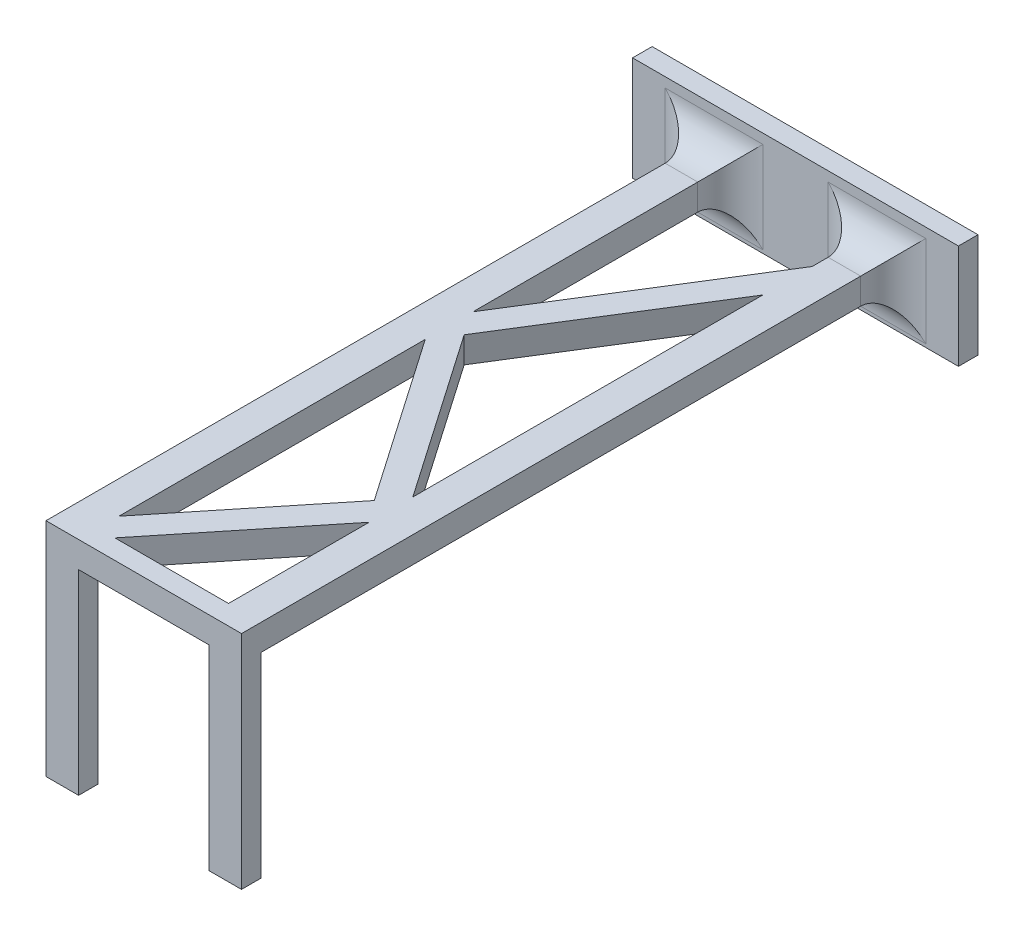
ISO-10303-21;
HEADER;
FILE_DESCRIPTION(('STEP AP214'),'2;1');
FILE_NAME('part.step','',(''),(''),'','','');
FILE_SCHEMA(('AUTOMOTIVE_DESIGN { 1 0 10303 214 1 1 1 1 }'));
ENDSEC;
DATA;
#1=APPLICATION_CONTEXT('core data for automotive mechanical design processes');
#2=APPLICATION_PROTOCOL_DEFINITION('international standard','automotive_design',2000,#1);
#3=PRODUCT_CONTEXT('',#1,'mechanical');
#4=PRODUCT('Part','Part','',(#3));
#5=PRODUCT_RELATED_PRODUCT_CATEGORY('part','',(#4));
#6=PRODUCT_DEFINITION_FORMATION('','',#4);
#7=PRODUCT_DEFINITION_CONTEXT('part definition',#1,'design');
#8=PRODUCT_DEFINITION('design','',#6,#7);
#9=PRODUCT_DEFINITION_SHAPE('','',#8);
#10=(LENGTH_UNIT() NAMED_UNIT(*) SI_UNIT(.MILLI.,.METRE.));
#11=(NAMED_UNIT(*) PLANE_ANGLE_UNIT() SI_UNIT($,.RADIAN.));
#12=(NAMED_UNIT(*) SI_UNIT($,.STERADIAN.) SOLID_ANGLE_UNIT());
#13=UNCERTAINTY_MEASURE_WITH_UNIT(LENGTH_MEASURE(1.E-05),#10,'distance_accuracy_value','');
#14=(GEOMETRIC_REPRESENTATION_CONTEXT(3) GLOBAL_UNCERTAINTY_ASSIGNED_CONTEXT((#13)) GLOBAL_UNIT_ASSIGNED_CONTEXT((#10,
#11,#12)) REPRESENTATION_CONTEXT('',''));
#15=CARTESIAN_POINT('',(0.,0.,0.));
#16=DIRECTION('',(0.,0.,1.));
#17=DIRECTION('',(1.,0.,0.));
#18=AXIS2_PLACEMENT_3D('',#15,#16,#17);
#19=CARTESIAN_POINT('',(-22.1490467937608,-2.12911611785095,103.));
#20=DIRECTION('',(0.,1.,0.));
#21=DIRECTION('',(0.,0.,1.));
#22=AXIS2_PLACEMENT_3D('',#19,#20,#21);
#23=PLANE('',#22);
#24=DIRECTION('',(0.,0.,-1.));
#25=VECTOR('',#24,1.);
#26=CARTESIAN_POINT('',(17.8509532062392,-2.12911611785095,0.));
#27=LINE('',#26,#25);
#28=CARTESIAN_POINT('',(17.8509532062392,-2.12911611785095,71.7156301458142));
#29=VERTEX_POINT('',#28);
#30=CARTESIAN_POINT('',(17.8509532062392,-2.12911611785095,18.0112892517933));
#31=VERTEX_POINT('',#30);
#32=EDGE_CURVE('E549',#29,#31,#27,.T.);
#33=ORIENTED_EDGE('',*,*,#32,.T.);
#34=DIRECTION('',(0.529773344430949,0.,-0.848139259514879));
#35=VECTOR('',#34,1.);
#36=CARTESIAN_POINT('',(20.9337691139666,-2.12911611785095,13.0758631328949));
#37=LINE('',#36,#35);
#38=CARTESIAN_POINT('',(0.231428363725535,-2.12911611785095,46.2192217761925));
#39=VERTEX_POINT('',#38);
#40=EDGE_CURVE('E536',#39,#31,#37,.T.);
#41=ORIENTED_EDGE('',*,*,#40,.F.);
#42=DIRECTION('',(-0.568515396426221,0.,-0.822672622630859));
#43=VECTOR('',#42,1.);
#44=CARTESIAN_POINT('',(-21.4601964163114,-2.12911611785095,14.8302638709278));
#45=LINE('',#44,#43);
#46=EDGE_CURVE('E545',#29,#39,#45,.T.);
#47=ORIENTED_EDGE('',*,*,#46,.F.);
#48=EDGE_LOOP('',(#33,#41,#47));
#49=FACE_BOUND('',#48,.T.);
#50=DIRECTION('',(-0.568515396426221,0.,-0.82267262263086));
#51=VECTOR('',#50,1.);
#52=CARTESIAN_POINT('',(-24.7508869068349,-2.12911611785095,17.1043254566327));
#53=LINE('',#52,#51);
#54=CARTESIAN_POINT('',(15.3554770407737,-2.12911611785095,75.1404100031111));
#55=VERTEX_POINT('',#54);
#56=CARTESIAN_POINT('',(-2.14904679376084,-2.12911611785095,49.810414331253));
#57=VERTEX_POINT('',#56);
#58=EDGE_CURVE('E524',#55,#57,#53,.T.);
#59=ORIENTED_EDGE('',*,*,#58,.T.);
#60=DIRECTION('',(0.,0.,-1.));
#61=VECTOR('',#60,1.);
#62=CARTESIAN_POINT('',(-2.14904679376083,-2.12911611785095,0.));
#63=LINE('',#62,#61);
#64=CARTESIAN_POINT('',(-2.14904679376085,-2.12911611785095,96.8166427882165));
#65=VERTEX_POINT('',#64);
#66=EDGE_CURVE('E510',#65,#57,#63,.T.);
#67=ORIENTED_EDGE('',*,*,#66,.F.);
#68=DIRECTION('',(0.628267538621431,0.,-0.777997364979194));
#69=VECTOR('',#68,1.);
#70=CARTESIAN_POINT('',(46.022279396746,-2.12911611785095,37.1650412969132));
#71=LINE('',#70,#69);
#72=EDGE_CURVE('E520',#65,#55,#71,.T.);
#73=ORIENTED_EDGE('',*,*,#72,.T.);
#74=EDGE_LOOP('',(#59,#67,#73));
#75=FACE_BOUND('',#74,.T.);
#76=DIRECTION('',(0.,0.,-1.));
#77=VECTOR('',#76,1.);
#78=CARTESIAN_POINT('',(17.8509532062392,-2.12911611785095,0.));
#79=LINE('',#78,#77);
#80=CARTESIAN_POINT('',(17.8509532062392,-2.12911611785095,10.4608904972154));
#81=VERTEX_POINT('',#80);
#82=CARTESIAN_POINT('',(17.8509532062392,-2.12911611785095,8.00000000000001));
#83=VERTEX_POINT('',#82);
#84=EDGE_CURVE('E557',#81,#83,#79,.T.);
#85=ORIENTED_EDGE('',*,*,#84,.T.);
#86=DIRECTION('',(1.,0.,0.));
#87=VECTOR('',#86,1.);
#88=CARTESIAN_POINT('',(-22.1490467937608,-2.12911611785095,8.00000000000001));
#89=LINE('',#88,#87);
#90=CARTESIAN_POINT('',(22.8509532062393,-2.12911611785095,8.00000000000001));
#91=VERTEX_POINT('',#90);
#92=EDGE_CURVE('E415',#83,#91,#89,.T.);
#93=ORIENTED_EDGE('',*,*,#92,.T.);
#94=DIRECTION('',(0.,0.,-1.));
#95=VECTOR('',#94,1.);
#96=CARTESIAN_POINT('',(22.8509532062393,-2.12911611785095,0.));
#97=LINE('',#96,#95);
#98=CARTESIAN_POINT('',(22.8509532062392,-2.12911611785095,100.));
#99=VERTEX_POINT('',#98);
#100=EDGE_CURVE('E505',#99,#91,#97,.T.);
#101=ORIENTED_EDGE('',*,*,#100,.F.);
#102=DIRECTION('',(1.,0.,0.));
#103=VECTOR('',#102,1.);
#104=CARTESIAN_POINT('',(17.8509532062392,-2.12911611785095,100.));
#105=LINE('',#104,#103);
#106=CARTESIAN_POINT('',(17.8509532062392,-2.12911611785095,100.));
#107=VERTEX_POINT('',#106);
#108=EDGE_CURVE('E596',#107,#99,#105,.T.);
#109=ORIENTED_EDGE('',*,*,#108,.F.);
#110=DIRECTION('',(0.,0.,-1.));
#111=VECTOR('',#110,1.);
#112=CARTESIAN_POINT('',(17.8509532062392,-2.12911611785095,100.));
#113=LINE('',#112,#111);
#114=CARTESIAN_POINT('',(17.8509532062392,-2.12911611785095,78.4169219862328));
#115=VERTEX_POINT('',#114);
#116=EDGE_CURVE('E489',#107,#115,#113,.T.);
#117=ORIENTED_EDGE('',*,*,#116,.T.);
#118=DIRECTION('',(0.628267538621431,0.,-0.777997364979194));
#119=VECTOR('',#118,1.);
#120=CARTESIAN_POINT('',(0.421656000397723,-2.12911611785095,100.));
#121=LINE('',#120,#119);
#122=CARTESIAN_POINT('',(0.421656000397719,-2.12911611785095,100.));
#123=VERTEX_POINT('',#122);
#124=EDGE_CURVE('E498',#123,#115,#121,.T.);
#125=ORIENTED_EDGE('',*,*,#124,.F.);
#126=DIRECTION('',(-1.,0.,0.));
#127=VECTOR('',#126,1.);
#128=CARTESIAN_POINT('',(17.8509532062392,-2.12911611785095,100.));
#129=LINE('',#128,#127);
#130=EDGE_CURVE('E502',#107,#123,#129,.T.);
#131=ORIENTED_EDGE('',*,*,#130,.F.);
#132=DIRECTION('',(0.,0.,-1.));
#133=VECTOR('',#132,1.);
#134=CARTESIAN_POINT('',(17.8509532062392,-2.12911611785095,103.));
#135=LINE('',#134,#133);
#136=CARTESIAN_POINT('',(17.8509532062392,-2.12911611785095,103.));
#137=VERTEX_POINT('',#136);
#138=EDGE_CURVE('E628',#137,#107,#135,.T.);
#139=ORIENTED_EDGE('',*,*,#138,.F.);
#140=DIRECTION('',(1.,0.,0.));
#141=VECTOR('',#140,1.);
#142=CARTESIAN_POINT('',(-22.1490467937608,-2.12911611785095,103.));
#143=LINE('',#142,#141);
#144=CARTESIAN_POINT('',(-2.14904679376084,-2.12911611785095,103.));
#145=VERTEX_POINT('',#144);
#146=EDGE_CURVE('E613',#145,#137,#143,.T.);
#147=ORIENTED_EDGE('',*,*,#146,.F.);
#148=DIRECTION('',(0.,0.,1.));
#149=VECTOR('',#148,1.);
#150=CARTESIAN_POINT('',(-2.14904679376083,-2.12911611785095,103.));
#151=LINE('',#150,#149);
#152=CARTESIAN_POINT('',(-2.14904679376083,-2.12911611785095,100.));
#153=VERTEX_POINT('',#152);
#154=EDGE_CURVE('E583',#153,#145,#151,.T.);
#155=ORIENTED_EDGE('',*,*,#154,.F.);
#156=DIRECTION('',(1.,0.,0.));
#157=VECTOR('',#156,1.);
#158=CARTESIAN_POINT('',(-7.14904679376083,-2.12911611785095,100.));
#159=LINE('',#158,#157);
#160=CARTESIAN_POINT('',(-7.14904679376083,-2.12911611785095,100.));
#161=VERTEX_POINT('',#160);
#162=EDGE_CURVE('E593',#161,#153,#159,.T.);
#163=ORIENTED_EDGE('',*,*,#162,.F.);
#164=DIRECTION('',(0.,0.,-1.));
#165=VECTOR('',#164,1.);
#166=CARTESIAN_POINT('',(-7.14904679376082,-2.12911611785095,0.));
#167=LINE('',#166,#165);
#168=CARTESIAN_POINT('',(-7.14904679376082,-2.12911611785095,8.00000000000001));
#169=VERTEX_POINT('',#168);
#170=EDGE_CURVE('E479',#161,#169,#167,.T.);
#171=ORIENTED_EDGE('',*,*,#170,.T.);
#172=DIRECTION('',(1.,0.,0.));
#173=VECTOR('',#172,1.);
#174=CARTESIAN_POINT('',(-22.1490467937608,-2.12911611785095,8.00000000000001));
#175=LINE('',#174,#173);
#176=CARTESIAN_POINT('',(-2.14904679376083,-2.12911611785095,8.00000000000001));
#177=VERTEX_POINT('',#176);
#178=EDGE_CURVE('E412',#169,#177,#175,.T.);
#179=ORIENTED_EDGE('',*,*,#178,.T.);
#180=DIRECTION('',(0.,0.,-1.));
#181=VECTOR('',#180,1.);
#182=CARTESIAN_POINT('',(-2.14904679376084,-2.12911611785095,0.));
#183=LINE('',#182,#181);
#184=CARTESIAN_POINT('',(-2.14904679376082,-2.12911611785095,42.4798385409641));
#185=VERTEX_POINT('',#184);
#186=EDGE_CURVE('E563',#185,#177,#183,.T.);
#187=ORIENTED_EDGE('',*,*,#186,.F.);
#188=DIRECTION('',(0.52977334443095,0.,-0.848139259514878));
#189=VECTOR('',#188,1.);
#190=CARTESIAN_POINT('',(17.5412120759071,-2.12911611785095,10.9567697551711));
#191=LINE('',#190,#189);
#192=EDGE_CURVE('E484',#185,#81,#191,.T.);
#193=ORIENTED_EDGE('',*,*,#192,.T.);
#194=EDGE_LOOP('',(#85,#93,#101,#109,#117,#125,#131,#139,#147,#155,#163,#171,#179,#187,#193));
#195=FACE_BOUND('',#194,.T.);
#196=ADVANCED_FACE('F102',(#49,#75,#195),#23,.F.);
#197=CARTESIAN_POINT('',(-22.1490467937608,1.87088388214905,103.));
#198=DIRECTION('',(0.,-1.,0.));
#199=DIRECTION('',(0.,0.,-1.));
#200=AXIS2_PLACEMENT_3D('',#197,#198,#199);
#201=PLANE('',#200);
#202=DIRECTION('',(0.,0.,-1.));
#203=VECTOR('',#202,1.);
#204=CARTESIAN_POINT('',(17.8509532062392,1.87088388214905,103.));
#205=LINE('',#204,#203);
#206=CARTESIAN_POINT('',(17.8509532062392,1.87088388214905,71.7156301458142));
#207=VERTEX_POINT('',#206);
#208=CARTESIAN_POINT('',(17.8509532062392,1.87088388214905,18.0112892517933));
#209=VERTEX_POINT('',#208);
#210=EDGE_CURVE('E367',#207,#209,#205,.T.);
#211=ORIENTED_EDGE('',*,*,#210,.F.);
#212=DIRECTION('',(-0.568515396426221,0.,-0.82267262263086));
#213=VECTOR('',#212,1.);
#214=CARTESIAN_POINT('',(19.5543269493781,1.87088388214905,74.1805043662795));
#215=LINE('',#214,#213);
#216=CARTESIAN_POINT('',(0.231428363725535,1.87088388214905,46.2192217761925));
#217=VERTEX_POINT('',#216);
#218=EDGE_CURVE('E359',#207,#217,#215,.T.);
#219=ORIENTED_EDGE('',*,*,#218,.T.);
#220=DIRECTION('',(0.529773344430949,0.,-0.848139259514879));
#221=VECTOR('',#220,1.);
#222=CARTESIAN_POINT('',(-31.5626997729727,1.87088388214905,97.1199486214541));
#223=LINE('',#222,#221);
#224=EDGE_CURVE('E363',#217,#209,#223,.T.);
#225=ORIENTED_EDGE('',*,*,#224,.T.);
#226=EDGE_LOOP('',(#211,#219,#225));
#227=FACE_BOUND('',#226,.T.);
#228=DIRECTION('',(-0.568515396426221,0.,-0.82267262263086));
#229=VECTOR('',#228,1.);
#230=CARTESIAN_POINT('',(16.2636364588546,1.87088388214905,76.4545659519844));
#231=LINE('',#230,#229);
#232=CARTESIAN_POINT('',(15.3554770407737,1.87088388214905,75.1404100031111));
#233=VERTEX_POINT('',#232);
#234=CARTESIAN_POINT('',(-2.14904679376084,1.87088388214905,49.810414331253));
#235=VERTEX_POINT('',#234);
#236=EDGE_CURVE('E345',#233,#235,#231,.T.);
#237=ORIENTED_EDGE('',*,*,#236,.F.);
#238=DIRECTION('',(0.628267538621431,0.,-0.777997364979194));
#239=VECTOR('',#238,1.);
#240=CARTESIAN_POINT('',(-13.0658149940762,1.87088388214905,110.33511441349));
#241=LINE('',#240,#239);
#242=CARTESIAN_POINT('',(-2.14904679376086,1.87088388214905,96.8166427882165));
#243=VERTEX_POINT('',#242);
#244=EDGE_CURVE('E328',#243,#233,#241,.T.);
#245=ORIENTED_EDGE('',*,*,#244,.F.);
#246=DIRECTION('',(0.,0.,-1.));
#247=VECTOR('',#246,1.);
#248=CARTESIAN_POINT('',(-2.14904679376085,1.87088388214905,103.));
#249=LINE('',#248,#247);
#250=EDGE_CURVE('E341',#243,#235,#249,.T.);
#251=ORIENTED_EDGE('',*,*,#250,.T.);
#252=EDGE_LOOP('',(#237,#245,#251));
#253=FACE_BOUND('',#252,.T.);
#254=DIRECTION('',(0.,0.,-1.));
#255=VECTOR('',#254,1.);
#256=CARTESIAN_POINT('',(17.8509532062392,1.87088388214905,103.));
#257=LINE('',#256,#255);
#258=CARTESIAN_POINT('',(17.8509532062392,1.87088388214905,100.));
#259=VERTEX_POINT('',#258);
#260=CARTESIAN_POINT('',(17.8509532062392,1.87088388214905,78.4169219862328));
#261=VERTEX_POINT('',#260);
#262=EDGE_CURVE('E374',#259,#261,#257,.T.);
#263=ORIENTED_EDGE('',*,*,#262,.F.);
#264=DIRECTION('',(-1.,0.,0.));
#265=VECTOR('',#264,1.);
#266=CARTESIAN_POINT('',(-22.1490467937608,1.87088388214905,100.));
#267=LINE('',#266,#265);
#268=CARTESIAN_POINT('',(0.421656000397723,1.87088388214905,100.));
#269=VERTEX_POINT('',#268);
#270=EDGE_CURVE('E378',#259,#269,#267,.T.);
#271=ORIENTED_EDGE('',*,*,#270,.T.);
#272=DIRECTION('',(0.628267538621431,0.,-0.777997364979194));
#273=VECTOR('',#272,1.);
#274=CARTESIAN_POINT('',(-9.95382553415938,1.87088388214905,112.848184567975));
#275=LINE('',#274,#273);
#276=EDGE_CURVE('E370',#269,#261,#275,.T.);
#277=ORIENTED_EDGE('',*,*,#276,.T.);
#278=EDGE_LOOP('',(#263,#271,#277));
#279=FACE_BOUND('',#278,.T.);
#280=DIRECTION('',(0.,0.,-1.));
#281=VECTOR('',#280,1.);
#282=CARTESIAN_POINT('',(-2.14904679376078,1.87088388214905,103.));
#283=LINE('',#282,#281);
#284=CARTESIAN_POINT('',(-2.14904679376082,1.87088388214905,42.4798385409641));
#285=VERTEX_POINT('',#284);
#286=CARTESIAN_POINT('',(-2.14904679376083,1.87088388214905,8.00000000000001));
#287=VERTEX_POINT('',#286);
#288=EDGE_CURVE('E348',#285,#287,#283,.T.);
#289=ORIENTED_EDGE('',*,*,#288,.T.);
#290=DIRECTION('',(-1.,0.,0.));
#291=VECTOR('',#290,1.);
#292=CARTESIAN_POINT('',(-22.1490467937608,1.87088388214905,8.00000000000001));
#293=LINE('',#292,#291);
#294=CARTESIAN_POINT('',(-7.14904679376082,1.87088388214905,8.00000000000001));
#295=VERTEX_POINT('',#294);
#296=EDGE_CURVE('E428',#287,#295,#293,.T.);
#297=ORIENTED_EDGE('',*,*,#296,.T.);
#298=DIRECTION('',(0.,0.,-1.));
#299=VECTOR('',#298,1.);
#300=CARTESIAN_POINT('',(-7.14904679376083,1.87088388214905,103.));
#301=LINE('',#300,#299);
#302=CARTESIAN_POINT('',(-7.14904679376083,1.87088388214905,103.));
#303=VERTEX_POINT('',#302);
#304=EDGE_CURVE('E573',#303,#295,#301,.T.);
#305=ORIENTED_EDGE('',*,*,#304,.F.);
#306=DIRECTION('',(-1.,0.,0.));
#307=VECTOR('',#306,1.);
#308=CARTESIAN_POINT('',(-22.1490467937608,1.87088388214905,103.));
#309=LINE('',#308,#307);
#310=CARTESIAN_POINT('',(22.8509532062392,1.87088388214905,103.));
#311=VERTEX_POINT('',#310);
#312=EDGE_CURVE('E334',#311,#303,#309,.T.);
#313=ORIENTED_EDGE('',*,*,#312,.F.);
#314=DIRECTION('',(0.,0.,-1.));
#315=VECTOR('',#314,1.);
#316=CARTESIAN_POINT('',(22.8509532062392,1.87088388214905,103.));
#317=LINE('',#316,#315);
#318=CARTESIAN_POINT('',(22.8509532062393,1.87088388214905,8.00000000000001));
#319=VERTEX_POINT('',#318);
#320=EDGE_CURVE('E483',#311,#319,#317,.T.);
#321=ORIENTED_EDGE('',*,*,#320,.T.);
#322=DIRECTION('',(-1.,0.,0.));
#323=VECTOR('',#322,1.);
#324=CARTESIAN_POINT('',(-22.1490467937608,1.87088388214905,8.00000000000001));
#325=LINE('',#324,#323);
#326=CARTESIAN_POINT('',(17.8509532062392,1.87088388214905,8.00000000000001));
#327=VERTEX_POINT('',#326);
#328=EDGE_CURVE('E425',#319,#327,#325,.T.);
#329=ORIENTED_EDGE('',*,*,#328,.T.);
#330=DIRECTION('',(0.,0.,-1.));
#331=VECTOR('',#330,1.);
#332=CARTESIAN_POINT('',(17.8509532062391,1.87088388214905,103.));
#333=LINE('',#332,#331);
#334=CARTESIAN_POINT('',(17.8509532062392,1.87088388214905,10.4608904972154));
#335=VERTEX_POINT('',#334);
#336=EDGE_CURVE('E355',#335,#327,#333,.T.);
#337=ORIENTED_EDGE('',*,*,#336,.F.);
#338=DIRECTION('',(0.52977334443095,0.,-0.848139259514878));
#339=VECTOR('',#338,1.);
#340=CARTESIAN_POINT('',(-34.9552568110323,1.87088388214905,95.0008552437302));
#341=LINE('',#340,#339);
#342=EDGE_CURVE('E352',#285,#335,#341,.T.);
#343=ORIENTED_EDGE('',*,*,#342,.F.);
#344=EDGE_LOOP('',(#289,#297,#305,#313,#321,#329,#337,#343));
#345=FACE_BOUND('',#344,.T.);
#346=ADVANCED_FACE('F663',(#227,#253,#279,#345),#201,.F.);
#347=CARTESIAN_POINT('',(0.,0.,103.));
#348=DIRECTION('',(0.,0.,1.));
#349=DIRECTION('',(1.,0.,0.));
#350=AXIS2_PLACEMENT_3D('',#347,#348,#349);
#351=PLANE('',#350);
#352=ORIENTED_EDGE('',*,*,#312,.T.);
#353=DIRECTION('',(0.,1.,0.));
#354=VECTOR('',#353,1.);
#355=CARTESIAN_POINT('',(-7.14904679376083,-32.1291161178509,103.));
#356=LINE('',#355,#354);
#357=CARTESIAN_POINT('',(-7.14904679376083,-32.1291161178509,103.));
#358=VERTEX_POINT('',#357);
#359=EDGE_CURVE('E592',#358,#303,#356,.T.);
#360=ORIENTED_EDGE('',*,*,#359,.F.);
#361=DIRECTION('',(-1.,0.,0.));
#362=VECTOR('',#361,1.);
#363=CARTESIAN_POINT('',(-7.14904679376083,-32.1291161178509,103.));
#364=LINE('',#363,#362);
#365=CARTESIAN_POINT('',(-2.14904679376083,-32.1291161178509,103.));
#366=VERTEX_POINT('',#365);
#367=EDGE_CURVE('E589',#366,#358,#364,.T.);
#368=ORIENTED_EDGE('',*,*,#367,.F.);
#369=DIRECTION('',(0.,1.,0.));
#370=VECTOR('',#369,1.);
#371=CARTESIAN_POINT('',(-2.14904679376083,-32.1291161178509,103.));
#372=LINE('',#371,#370);
#373=EDGE_CURVE('E602',#366,#145,#372,.T.);
#374=ORIENTED_EDGE('',*,*,#373,.T.);
#375=ORIENTED_EDGE('',*,*,#146,.T.);
#376=DIRECTION('',(0.,1.,0.));
#377=VECTOR('',#376,1.);
#378=CARTESIAN_POINT('',(17.8509532062392,-32.1291161178509,103.));
#379=LINE('',#378,#377);
#380=CARTESIAN_POINT('',(17.8509532062392,-32.1291161178509,103.));
#381=VERTEX_POINT('',#380);
#382=EDGE_CURVE('E620',#381,#137,#379,.T.);
#383=ORIENTED_EDGE('',*,*,#382,.F.);
#384=DIRECTION('',(-1.,0.,0.));
#385=VECTOR('',#384,1.);
#386=CARTESIAN_POINT('',(17.8509532062392,-32.1291161178509,103.));
#387=LINE('',#386,#385);
#388=CARTESIAN_POINT('',(22.8509532062392,-32.1291161178509,103.));
#389=VERTEX_POINT('',#388);
#390=EDGE_CURVE('E638',#389,#381,#387,.T.);
#391=ORIENTED_EDGE('',*,*,#390,.F.);
#392=DIRECTION('',(0.,1.,0.));
#393=VECTOR('',#392,1.);
#394=CARTESIAN_POINT('',(22.8509532062392,-32.1291161178509,103.));
#395=LINE('',#394,#393);
#396=EDGE_CURVE('E617',#389,#311,#395,.T.);
#397=ORIENTED_EDGE('',*,*,#396,.T.);
#398=EDGE_LOOP('',(#352,#360,#368,#374,#375,#383,#391,#397));
#399=FACE_BOUND('',#398,.T.);
#400=ADVANCED_FACE('F655',(#399),#351,.T.);
#401=CARTESIAN_POINT('',(-22.1490467937608,-7.62911611785095,3.));
#402=DIRECTION('',(0.,1.,0.));
#403=DIRECTION('',(0.,0.,1.));
#404=AXIS2_PLACEMENT_3D('',#401,#402,#403);
#405=PLANE('',#404);
#406=DIRECTION('',(1.,0.,0.));
#407=VECTOR('',#406,1.);
#408=CARTESIAN_POINT('',(-22.1490467937608,-7.62911611785095,3.));
#409=LINE('',#408,#407);
#410=CARTESIAN_POINT('',(-17.1490467937608,-7.62911611785095,3.));
#411=VERTEX_POINT('',#410);
#412=CARTESIAN_POINT('',(32.8509532062392,-7.62911611785095,3.));
#413=VERTEX_POINT('',#412);
#414=EDGE_CURVE('E316',#411,#413,#409,.T.);
#415=ORIENTED_EDGE('',*,*,#414,.F.);
#416=DIRECTION('',(0.,0.,1.));
#417=VECTOR('',#416,1.);
#418=CARTESIAN_POINT('',(-17.1490467937608,-7.62911611785095,-9.));
#419=LINE('',#418,#417);
#420=CARTESIAN_POINT('',(-17.1490467937608,-7.62911611785095,0.));
#421=VERTEX_POINT('',#420);
#422=EDGE_CURVE('E300',#421,#411,#419,.T.);
#423=ORIENTED_EDGE('',*,*,#422,.F.);
#424=DIRECTION('',(1.,0.,0.));
#425=VECTOR('',#424,1.);
#426=CARTESIAN_POINT('',(-22.1490467937608,-7.62911611785095,0.));
#427=LINE('',#426,#425);
#428=CARTESIAN_POINT('',(32.8509532062392,-7.62911611785095,0.));
#429=VERTEX_POINT('',#428);
#430=EDGE_CURVE('E331',#421,#429,#427,.T.);
#431=ORIENTED_EDGE('',*,*,#430,.T.);
#432=DIRECTION('',(0.,0.,1.));
#433=VECTOR('',#432,1.);
#434=CARTESIAN_POINT('',(32.8509532062392,-7.62911611785095,-9.));
#435=LINE('',#434,#433);
#436=EDGE_CURVE('E118',#429,#413,#435,.T.);
#437=ORIENTED_EDGE('',*,*,#436,.T.);
#438=EDGE_LOOP('',(#415,#423,#431,#437));
#439=FACE_BOUND('',#438,.T.);
#440=ADVANCED_FACE('F322',(#439),#405,.F.);
#441=CARTESIAN_POINT('',(-22.1490467937608,8.37088388214905,3.));
#442=DIRECTION('',(0.,-1.,0.));
#443=DIRECTION('',(0.,0.,-1.));
#444=AXIS2_PLACEMENT_3D('',#441,#442,#443);
#445=PLANE('',#444);
#446=DIRECTION('',(-1.,0.,0.));
#447=VECTOR('',#446,1.);
#448=CARTESIAN_POINT('',(-22.1490467937608,8.37088388214905,0.));
#449=LINE('',#448,#447);
#450=CARTESIAN_POINT('',(32.8509532062392,8.37088388214905,0.));
#451=VERTEX_POINT('',#450);
#452=CARTESIAN_POINT('',(-17.1490467937608,8.37088388214905,0.));
#453=VERTEX_POINT('',#452);
#454=EDGE_CURVE('E324',#451,#453,#449,.T.);
#455=ORIENTED_EDGE('',*,*,#454,.T.);
#456=DIRECTION('',(0.,0.,1.));
#457=VECTOR('',#456,1.);
#458=CARTESIAN_POINT('',(-17.1490467937608,8.37088388214905,-9.));
#459=LINE('',#458,#457);
#460=CARTESIAN_POINT('',(-17.1490467937608,8.37088388214905,3.));
#461=VERTEX_POINT('',#460);
#462=EDGE_CURVE('E126',#453,#461,#459,.T.);
#463=ORIENTED_EDGE('',*,*,#462,.T.);
#464=DIRECTION('',(-1.,0.,0.));
#465=VECTOR('',#464,1.);
#466=CARTESIAN_POINT('',(-22.1490467937608,8.37088388214905,3.));
#467=LINE('',#466,#465);
#468=CARTESIAN_POINT('',(32.8509532062392,8.37088388214905,3.));
#469=VERTEX_POINT('',#468);
#470=EDGE_CURVE('E318',#469,#461,#467,.T.);
#471=ORIENTED_EDGE('',*,*,#470,.F.);
#472=DIRECTION('',(0.,0.,1.));
#473=VECTOR('',#472,1.);
#474=CARTESIAN_POINT('',(32.8509532062392,8.37088388214905,-9.));
#475=LINE('',#474,#473);
#476=EDGE_CURVE('E468',#451,#469,#475,.T.);
#477=ORIENTED_EDGE('',*,*,#476,.F.);
#478=EDGE_LOOP('',(#455,#463,#471,#477));
#479=FACE_BOUND('',#478,.T.);
#480=ADVANCED_FACE('F470',(#479),#445,.F.);
#481=CARTESIAN_POINT('',(0.,0.,3.));
#482=DIRECTION('',(0.,0.,1.));
#483=DIRECTION('',(1.,0.,0.));
#484=AXIS2_PLACEMENT_3D('',#481,#482,#483);
#485=PLANE('',#484);
#486=DIRECTION('',(0.,1.,0.));
#487=VECTOR('',#486,1.);
#488=CARTESIAN_POINT('',(-17.1490467937608,8.37088388214905,3.));
#489=LINE('',#488,#487);
#490=EDGE_CURVE('E303',#411,#461,#489,.T.);
#491=ORIENTED_EDGE('',*,*,#490,.F.);
#492=ORIENTED_EDGE('',*,*,#414,.T.);
#493=DIRECTION('',(0.,-1.,0.));
#494=VECTOR('',#493,1.);
#495=CARTESIAN_POINT('',(32.8509532062392,8.37088388214905,3.));
#496=LINE('',#495,#494);
#497=EDGE_CURVE('E320',#469,#413,#496,.T.);
#498=ORIENTED_EDGE('',*,*,#497,.F.);
#499=ORIENTED_EDGE('',*,*,#470,.T.);
#500=EDGE_LOOP('',(#491,#492,#498,#499));
#501=FACE_BOUND('',#500,.T.);
#502=DIRECTION('',(-1.,0.,0.));
#503=VECTOR('',#502,1.);
#504=CARTESIAN_POINT('',(0.,6.87088388214905,3.));
#505=LINE('',#504,#503);
#506=CARTESIAN_POINT('',(-12.1490467937608,6.87088388214905,3.));
#507=VERTEX_POINT('',#506);
#508=CARTESIAN_POINT('',(2.85095320623917,6.87088388214905,3.));
#509=VERTEX_POINT('',#508);
#510=EDGE_CURVE('E395',#507,#509,#505,.F.);
#511=ORIENTED_EDGE('',*,*,#510,.T.);
#512=DIRECTION('',(0.,-1.,0.));
#513=VECTOR('',#512,1.);
#514=CARTESIAN_POINT('',(2.85095320623917,0.,3.));
#515=LINE('',#514,#513);
#516=CARTESIAN_POINT('',(2.85095320623917,-7.12911611785095,3.));
#517=VERTEX_POINT('',#516);
#518=EDGE_CURVE('E404',#509,#517,#515,.T.);
#519=ORIENTED_EDGE('',*,*,#518,.T.);
#520=DIRECTION('',(1.,0.,0.));
#521=VECTOR('',#520,1.);
#522=CARTESIAN_POINT('',(0.,-7.12911611785095,3.));
#523=LINE('',#522,#521);
#524=CARTESIAN_POINT('',(-12.1490467937608,-7.12911611785095,3.));
#525=VERTEX_POINT('',#524);
#526=EDGE_CURVE('E401',#517,#525,#523,.F.);
#527=ORIENTED_EDGE('',*,*,#526,.T.);
#528=DIRECTION('',(0.,-1.,0.));
#529=VECTOR('',#528,1.);
#530=CARTESIAN_POINT('',(-12.1490467937608,0.,3.));
#531=LINE('',#530,#529);
#532=EDGE_CURVE('E398',#525,#507,#531,.F.);
#533=ORIENTED_EDGE('',*,*,#532,.T.);
#534=EDGE_LOOP('',(#511,#519,#527,#533));
#535=FACE_BOUND('',#534,.T.);
#536=DIRECTION('',(-1.,0.,0.));
#537=VECTOR('',#536,1.);
#538=CARTESIAN_POINT('',(0.,6.87088388214905,3.));
#539=LINE('',#538,#537);
#540=CARTESIAN_POINT('',(12.8509532062392,6.87088388214905,3.));
#541=VERTEX_POINT('',#540);
#542=CARTESIAN_POINT('',(27.8509532062393,6.87088388214905,3.));
#543=VERTEX_POINT('',#542);
#544=EDGE_CURVE('E382',#541,#543,#539,.F.);
#545=ORIENTED_EDGE('',*,*,#544,.T.);
#546=DIRECTION('',(0.,-1.,0.));
#547=VECTOR('',#546,1.);
#548=CARTESIAN_POINT('',(27.8509532062393,0.,3.));
#549=LINE('',#548,#547);
#550=CARTESIAN_POINT('',(27.8509532062393,-7.12911611785095,3.));
#551=VERTEX_POINT('',#550);
#552=EDGE_CURVE('E391',#543,#551,#549,.T.);
#553=ORIENTED_EDGE('',*,*,#552,.T.);
#554=DIRECTION('',(1.,0.,0.));
#555=VECTOR('',#554,1.);
#556=CARTESIAN_POINT('',(0.,-7.12911611785095,3.));
#557=LINE('',#556,#555);
#558=CARTESIAN_POINT('',(12.8509532062392,-7.12911611785095,3.));
#559=VERTEX_POINT('',#558);
#560=EDGE_CURVE('E388',#551,#559,#557,.F.);
#561=ORIENTED_EDGE('',*,*,#560,.T.);
#562=DIRECTION('',(0.,-1.,0.));
#563=VECTOR('',#562,1.);
#564=CARTESIAN_POINT('',(12.8509532062392,1.87088388214905,3.));
#565=LINE('',#564,#563);
#566=EDGE_CURVE('E385',#559,#541,#565,.F.);
#567=ORIENTED_EDGE('',*,*,#566,.T.);
#568=EDGE_LOOP('',(#545,#553,#561,#567));
#569=FACE_BOUND('',#568,.T.);
#570=ADVANCED_FACE('F313',(#501,#535,#569),#485,.T.);
#571=CARTESIAN_POINT('',(0.,0.,0.));
#572=DIRECTION('',(0.,0.,1.));
#573=DIRECTION('',(1.,0.,0.));
#574=AXIS2_PLACEMENT_3D('',#571,#572,#573);
#575=PLANE('',#574);
#576=ORIENTED_EDGE('',*,*,#430,.F.);
#577=DIRECTION('',(0.,1.,0.));
#578=VECTOR('',#577,1.);
#579=CARTESIAN_POINT('',(-17.1490467937608,0.,0.));
#580=LINE('',#579,#578);
#581=EDGE_CURVE('E12',#421,#453,#580,.T.);
#582=ORIENTED_EDGE('',*,*,#581,.T.);
#583=ORIENTED_EDGE('',*,*,#454,.F.);
#584=DIRECTION('',(0.,-1.,0.));
#585=VECTOR('',#584,1.);
#586=CARTESIAN_POINT('',(32.8509532062392,0.,0.));
#587=LINE('',#586,#585);
#588=EDGE_CURVE('E111',#451,#429,#587,.T.);
#589=ORIENTED_EDGE('',*,*,#588,.T.);
#590=EDGE_LOOP('',(#576,#582,#583,#589));
#591=FACE_BOUND('',#590,.T.);
#592=ADVANCED_FACE('F465',(#591),#575,.F.);
#593=CARTESIAN_POINT('',(17.8509532062392,-32.1291161178509,100.));
#594=DIRECTION('',(0.,0.,1.));
#595=DIRECTION('',(1.,0.,0.));
#596=AXIS2_PLACEMENT_3D('',#593,#594,#595);
#597=PLANE('',#596);
#598=ORIENTED_EDGE('',*,*,#108,.T.);
#599=DIRECTION('',(0.,1.,0.));
#600=VECTOR('',#599,1.);
#601=CARTESIAN_POINT('',(22.8509532062392,-32.1291161178509,100.));
#602=LINE('',#601,#600);
#603=CARTESIAN_POINT('',(22.8509532062392,-32.1291161178509,100.));
#604=VERTEX_POINT('',#603);
#605=EDGE_CURVE('E577',#604,#99,#602,.T.);
#606=ORIENTED_EDGE('',*,*,#605,.F.);
#607=DIRECTION('',(1.,0.,0.));
#608=VECTOR('',#607,1.);
#609=CARTESIAN_POINT('',(17.8509532062392,-32.1291161178509,100.));
#610=LINE('',#609,#608);
#611=CARTESIAN_POINT('',(17.8509532062392,-32.1291161178509,100.));
#612=VERTEX_POINT('',#611);
#613=EDGE_CURVE('E632',#612,#604,#610,.T.);
#614=ORIENTED_EDGE('',*,*,#613,.F.);
#615=DIRECTION('',(0.,1.,0.));
#616=VECTOR('',#615,1.);
#617=CARTESIAN_POINT('',(17.8509532062392,-32.1291161178509,100.));
#618=LINE('',#617,#616);
#619=EDGE_CURVE('E623',#612,#107,#618,.T.);
#620=ORIENTED_EDGE('',*,*,#619,.T.);
#621=EDGE_LOOP('',(#598,#606,#614,#620));
#622=FACE_BOUND('',#621,.T.);
#623=ADVANCED_FACE('F719',(#622),#597,.F.);
#624=CARTESIAN_POINT('',(22.8509532062392,-32.1291161178509,103.));
#625=DIRECTION('',(-1.,0.,0.));
#626=DIRECTION('',(0.,0.,1.));
#627=AXIS2_PLACEMENT_3D('',#624,#625,#626);
#628=PLANE('',#627);
#629=ORIENTED_EDGE('',*,*,#100,.T.);
#630=DIRECTION('',(0.,-1.,0.));
#631=VECTOR('',#630,1.);
#632=CARTESIAN_POINT('',(22.8509532062393,-32.1291161178509,7.99999999999999));
#633=LINE('',#632,#631);
#634=EDGE_CURVE('E408',#91,#319,#633,.F.);
#635=ORIENTED_EDGE('',*,*,#634,.T.);
#636=ORIENTED_EDGE('',*,*,#320,.F.);
#637=ORIENTED_EDGE('',*,*,#396,.F.);
#638=DIRECTION('',(0.,0.,1.));
#639=VECTOR('',#638,1.);
#640=CARTESIAN_POINT('',(22.8509532062392,-32.1291161178509,103.));
#641=LINE('',#640,#639);
#642=EDGE_CURVE('E641',#604,#389,#641,.T.);
#643=ORIENTED_EDGE('',*,*,#642,.F.);
#644=ORIENTED_EDGE('',*,*,#605,.T.);
#645=EDGE_LOOP('',(#629,#635,#636,#637,#643,#644));
#646=FACE_BOUND('',#645,.T.);
#647=ADVANCED_FACE('F755',(#646),#628,.F.);
#648=CARTESIAN_POINT('',(17.8509532062392,-32.1291161178509,103.));
#649=DIRECTION('',(1.,0.,0.));
#650=DIRECTION('',(0.,0.,-1.));
#651=AXIS2_PLACEMENT_3D('',#648,#649,#650);
#652=PLANE('',#651);
#653=ORIENTED_EDGE('',*,*,#138,.T.);
#654=ORIENTED_EDGE('',*,*,#619,.F.);
#655=DIRECTION('',(0.,0.,-1.));
#656=VECTOR('',#655,1.);
#657=CARTESIAN_POINT('',(17.8509532062392,-32.1291161178509,103.));
#658=LINE('',#657,#656);
#659=EDGE_CURVE('E627',#381,#612,#658,.T.);
#660=ORIENTED_EDGE('',*,*,#659,.F.);
#661=ORIENTED_EDGE('',*,*,#382,.T.);
#662=EDGE_LOOP('',(#653,#654,#660,#661));
#663=FACE_BOUND('',#662,.T.);
#664=ADVANCED_FACE('F807',(#663),#652,.F.);
#665=CARTESIAN_POINT('',(0.,-32.1291161178509,0.));
#666=DIRECTION('',(0.,1.,0.));
#667=DIRECTION('',(0.,0.,1.));
#668=AXIS2_PLACEMENT_3D('',#665,#666,#667);
#669=PLANE('',#668);
#670=ORIENTED_EDGE('',*,*,#613,.T.);
#671=ORIENTED_EDGE('',*,*,#642,.T.);
#672=ORIENTED_EDGE('',*,*,#390,.T.);
#673=ORIENTED_EDGE('',*,*,#659,.T.);
#674=EDGE_LOOP('',(#670,#671,#672,#673));
#675=FACE_BOUND('',#674,.T.);
#676=ADVANCED_FACE('F801',(#675),#669,.F.);
#677=CARTESIAN_POINT('',(-7.14904679376083,-32.1291161178509,103.));
#678=DIRECTION('',(1.,0.,0.));
#679=DIRECTION('',(0.,0.,-1.));
#680=AXIS2_PLACEMENT_3D('',#677,#678,#679);
#681=PLANE('',#680);
#682=ORIENTED_EDGE('',*,*,#304,.T.);
#683=DIRECTION('',(0.,-1.,0.));
#684=VECTOR('',#683,1.);
#685=CARTESIAN_POINT('',(-7.14904679376081,-32.1291161178509,8.00000000000001));
#686=LINE('',#685,#684);
#687=EDGE_CURVE('E422',#295,#169,#686,.T.);
#688=ORIENTED_EDGE('',*,*,#687,.T.);
#689=ORIENTED_EDGE('',*,*,#170,.F.);
#690=DIRECTION('',(0.,1.,0.));
#691=VECTOR('',#690,1.);
#692=CARTESIAN_POINT('',(-7.14904679376083,-32.1291161178509,100.));
#693=LINE('',#692,#691);
#694=CARTESIAN_POINT('',(-7.14904679376083,-32.1291161178509,100.));
#695=VERTEX_POINT('',#694);
#696=EDGE_CURVE('E609',#695,#161,#693,.T.);
#697=ORIENTED_EDGE('',*,*,#696,.F.);
#698=DIRECTION('',(0.,0.,-1.));
#699=VECTOR('',#698,1.);
#700=CARTESIAN_POINT('',(-7.14904679376083,-32.1291161178509,103.));
#701=LINE('',#700,#699);
#702=EDGE_CURVE('E578',#358,#695,#701,.T.);
#703=ORIENTED_EDGE('',*,*,#702,.F.);
#704=ORIENTED_EDGE('',*,*,#359,.T.);
#705=EDGE_LOOP('',(#682,#688,#689,#697,#703,#704));
#706=FACE_BOUND('',#705,.T.);
#707=ADVANCED_FACE('F667',(#706),#681,.F.);
#708=CARTESIAN_POINT('',(-7.14904679376083,-32.1291161178509,100.));
#709=DIRECTION('',(0.,0.,1.));
#710=DIRECTION('',(1.,0.,0.));
#711=AXIS2_PLACEMENT_3D('',#708,#709,#710);
#712=PLANE('',#711);
#713=ORIENTED_EDGE('',*,*,#162,.T.);
#714=DIRECTION('',(0.,1.,0.));
#715=VECTOR('',#714,1.);
#716=CARTESIAN_POINT('',(-2.14904679376083,-32.1291161178509,100.));
#717=LINE('',#716,#715);
#718=CARTESIAN_POINT('',(-2.14904679376083,-32.1291161178509,100.));
#719=VERTEX_POINT('',#718);
#720=EDGE_CURVE('E605',#719,#153,#717,.T.);
#721=ORIENTED_EDGE('',*,*,#720,.F.);
#722=DIRECTION('',(1.,0.,0.));
#723=VECTOR('',#722,1.);
#724=CARTESIAN_POINT('',(-7.14904679376083,-32.1291161178509,100.));
#725=LINE('',#724,#723);
#726=EDGE_CURVE('E582',#695,#719,#725,.T.);
#727=ORIENTED_EDGE('',*,*,#726,.F.);
#728=ORIENTED_EDGE('',*,*,#696,.T.);
#729=EDGE_LOOP('',(#713,#721,#727,#728));
#730=FACE_BOUND('',#729,.T.);
#731=ADVANCED_FACE('F794',(#730),#712,.F.);
#732=CARTESIAN_POINT('',(-2.14904679376083,-32.1291161178509,103.));
#733=DIRECTION('',(-1.,0.,0.));
#734=DIRECTION('',(0.,0.,1.));
#735=AXIS2_PLACEMENT_3D('',#732,#733,#734);
#736=PLANE('',#735);
#737=ORIENTED_EDGE('',*,*,#154,.T.);
#738=ORIENTED_EDGE('',*,*,#373,.F.);
#739=DIRECTION('',(0.,0.,1.));
#740=VECTOR('',#739,1.);
#741=CARTESIAN_POINT('',(-2.14904679376083,-32.1291161178509,103.));
#742=LINE('',#741,#740);
#743=EDGE_CURVE('E586',#719,#366,#742,.T.);
#744=ORIENTED_EDGE('',*,*,#743,.F.);
#745=ORIENTED_EDGE('',*,*,#720,.T.);
#746=EDGE_LOOP('',(#737,#738,#744,#745));
#747=FACE_BOUND('',#746,.T.);
#748=ADVANCED_FACE('F790',(#747),#736,.F.);
#749=CARTESIAN_POINT('',(0.,-32.1291161178509,0.));
#750=DIRECTION('',(0.,-1.,0.));
#751=DIRECTION('',(0.,0.,-1.));
#752=AXIS2_PLACEMENT_3D('',#749,#750,#751);
#753=PLANE('',#752);
#754=ORIENTED_EDGE('',*,*,#702,.T.);
#755=ORIENTED_EDGE('',*,*,#726,.T.);
#756=ORIENTED_EDGE('',*,*,#743,.T.);
#757=ORIENTED_EDGE('',*,*,#367,.T.);
#758=EDGE_LOOP('',(#754,#755,#756,#757));
#759=FACE_BOUND('',#758,.T.);
#760=ADVANCED_FACE('F786',(#759),#753,.T.);
#761=CARTESIAN_POINT('',(-24.7508869068349,9.87088388214905,17.1043254566327));
#762=DIRECTION('',(-0.822672622630859,0.,0.568515396426221));
#763=DIRECTION('',(0.568515396426221,0.,0.82267262263086));
#764=AXIS2_PLACEMENT_3D('',#761,#762,#763);
#765=PLANE('',#764);
#766=ORIENTED_EDGE('',*,*,#236,.T.);
#767=DIRECTION('',(0.,-1.,0.));
#768=VECTOR('',#767,1.);
#769=CARTESIAN_POINT('',(-2.14904679376084,9.87088388214905,49.810414331253));
#770=LINE('',#769,#768);
#771=EDGE_CURVE('E514',#235,#57,#770,.T.);
#772=ORIENTED_EDGE('',*,*,#771,.T.);
#773=ORIENTED_EDGE('',*,*,#58,.F.);
#774=DIRECTION('',(0.,-1.,0.));
#775=VECTOR('',#774,1.);
#776=CARTESIAN_POINT('',(15.3554770407737,9.87088388214905,75.1404100031111));
#777=LINE('',#776,#775);
#778=EDGE_CURVE('E506',#233,#55,#777,.T.);
#779=ORIENTED_EDGE('',*,*,#778,.F.);
#780=EDGE_LOOP('',(#766,#772,#773,#779));
#781=FACE_BOUND('',#780,.T.);
#782=ADVANCED_FACE('F789',(#781),#765,.T.);
#783=CARTESIAN_POINT('',(-2.14904679376083,9.87088388214905,0.));
#784=DIRECTION('',(-1.,0.,0.));
#785=DIRECTION('',(0.,0.,1.));
#786=AXIS2_PLACEMENT_3D('',#783,#784,#785);
#787=PLANE('',#786);
#788=DIRECTION('',(0.,-1.,0.));
#789=VECTOR('',#788,1.);
#790=CARTESIAN_POINT('',(-2.14904679376085,9.87088388214905,96.8166427882165));
#791=LINE('',#790,#789);
#792=EDGE_CURVE('E511',#243,#65,#791,.T.);
#793=ORIENTED_EDGE('',*,*,#792,.T.);
#794=ORIENTED_EDGE('',*,*,#66,.T.);
#795=ORIENTED_EDGE('',*,*,#771,.F.);
#796=ORIENTED_EDGE('',*,*,#250,.F.);
#797=EDGE_LOOP('',(#793,#794,#795,#796));
#798=FACE_BOUND('',#797,.T.);
#799=ADVANCED_FACE('F777',(#798),#787,.F.);
#800=CARTESIAN_POINT('',(46.022279396746,9.87088388214905,37.1650412969132));
#801=DIRECTION('',(-0.777997364979194,0.,-0.628267538621431));
#802=DIRECTION('',(-0.628267538621431,0.,0.777997364979194));
#803=AXIS2_PLACEMENT_3D('',#800,#801,#802);
#804=PLANE('',#803);
#805=ORIENTED_EDGE('',*,*,#244,.T.);
#806=ORIENTED_EDGE('',*,*,#778,.T.);
#807=ORIENTED_EDGE('',*,*,#72,.F.);
#808=ORIENTED_EDGE('',*,*,#792,.F.);
#809=EDGE_LOOP('',(#805,#806,#807,#808));
#810=FACE_BOUND('',#809,.T.);
#811=ADVANCED_FACE('F769',(#810),#804,.T.);
#812=CARTESIAN_POINT('',(17.5412120759071,9.87088388214905,10.9567697551711));
#813=DIRECTION('',(-0.848139259514878,0.,-0.52977334443095));
#814=DIRECTION('',(-0.52977334443095,0.,0.848139259514878));
#815=AXIS2_PLACEMENT_3D('',#812,#813,#814);
#816=PLANE('',#815);
#817=ORIENTED_EDGE('',*,*,#342,.T.);
#818=DIRECTION('',(0.,-1.,0.));
#819=VECTOR('',#818,1.);
#820=CARTESIAN_POINT('',(17.8509532062392,9.87088388214905,10.4608904972154));
#821=LINE('',#820,#819);
#822=EDGE_CURVE('E553',#335,#81,#821,.T.);
#823=ORIENTED_EDGE('',*,*,#822,.T.);
#824=ORIENTED_EDGE('',*,*,#192,.F.);
#825=DIRECTION('',(0.,-1.,0.));
#826=VECTOR('',#825,1.);
#827=CARTESIAN_POINT('',(-2.14904679376082,9.87088388214905,42.4798385409641));
#828=LINE('',#827,#826);
#829=EDGE_CURVE('E554',#285,#185,#828,.T.);
#830=ORIENTED_EDGE('',*,*,#829,.F.);
#831=EDGE_LOOP('',(#817,#823,#824,#830));
#832=FACE_BOUND('',#831,.T.);
#833=ADVANCED_FACE('F767',(#832),#816,.T.);
#834=CARTESIAN_POINT('',(17.8509532062392,9.87088388214905,0.));
#835=DIRECTION('',(-1.,0.,0.));
#836=DIRECTION('',(0.,0.,1.));
#837=AXIS2_PLACEMENT_3D('',#834,#835,#836);
#838=PLANE('',#837);
#839=ORIENTED_EDGE('',*,*,#336,.T.);
#840=DIRECTION('',(0.,-1.,0.));
#841=VECTOR('',#840,1.);
#842=CARTESIAN_POINT('',(17.8509532062392,-2.12911611785095,8.00000000000001));
#843=LINE('',#842,#841);
#844=EDGE_CURVE('E431',#327,#83,#843,.T.);
#845=ORIENTED_EDGE('',*,*,#844,.T.);
#846=ORIENTED_EDGE('',*,*,#84,.F.);
#847=ORIENTED_EDGE('',*,*,#822,.F.);
#848=EDGE_LOOP('',(#839,#845,#846,#847));
#849=FACE_BOUND('',#848,.T.);
#850=ADVANCED_FACE('F765',(#849),#838,.T.);
#851=CARTESIAN_POINT('',(-2.14904679376084,9.87088388214905,0.));
#852=DIRECTION('',(-1.,0.,0.));
#853=DIRECTION('',(0.,0.,1.));
#854=AXIS2_PLACEMENT_3D('',#851,#852,#853);
#855=PLANE('',#854);
#856=ORIENTED_EDGE('',*,*,#186,.T.);
#857=DIRECTION('',(0.,-1.,0.));
#858=VECTOR('',#857,1.);
#859=CARTESIAN_POINT('',(-2.14904679376083,9.87088388214905,8.));
#860=LINE('',#859,#858);
#861=EDGE_CURVE('E418',#177,#287,#860,.F.);
#862=ORIENTED_EDGE('',*,*,#861,.T.);
#863=ORIENTED_EDGE('',*,*,#288,.F.);
#864=ORIENTED_EDGE('',*,*,#829,.T.);
#865=EDGE_LOOP('',(#856,#862,#863,#864));
#866=FACE_BOUND('',#865,.T.);
#867=ADVANCED_FACE('F688',(#866),#855,.F.);
#868=CARTESIAN_POINT('',(17.8509532062392,9.87088388214905,0.));
#869=DIRECTION('',(-1.,0.,0.));
#870=DIRECTION('',(0.,0.,1.));
#871=AXIS2_PLACEMENT_3D('',#868,#869,#870);
#872=PLANE('',#871);
#873=ORIENTED_EDGE('',*,*,#210,.T.);
#874=DIRECTION('',(0.,-1.,0.));
#875=VECTOR('',#874,1.);
#876=CARTESIAN_POINT('',(17.8509532062392,9.87088388214905,18.0112892517933));
#877=LINE('',#876,#875);
#878=EDGE_CURVE('E528',#209,#31,#877,.T.);
#879=ORIENTED_EDGE('',*,*,#878,.T.);
#880=ORIENTED_EDGE('',*,*,#32,.F.);
#881=DIRECTION('',(0.,-1.,0.));
#882=VECTOR('',#881,1.);
#883=CARTESIAN_POINT('',(17.8509532062392,9.87088388214905,71.7156301458142));
#884=LINE('',#883,#882);
#885=EDGE_CURVE('E532',#207,#29,#884,.T.);
#886=ORIENTED_EDGE('',*,*,#885,.F.);
#887=EDGE_LOOP('',(#873,#879,#880,#886));
#888=FACE_BOUND('',#887,.T.);
#889=ADVANCED_FACE('F784',(#888),#872,.T.);
#890=CARTESIAN_POINT('',(20.9337691139666,9.87088388214905,13.0758631328949));
#891=DIRECTION('',(-0.848139259514879,0.,-0.529773344430949));
#892=DIRECTION('',(-0.529773344430949,0.,0.848139259514879));
#893=AXIS2_PLACEMENT_3D('',#890,#891,#892);
#894=PLANE('',#893);
#895=DIRECTION('',(0.,-1.,0.));
#896=VECTOR('',#895,1.);
#897=CARTESIAN_POINT('',(0.231428363725535,9.87088388214905,46.2192217761925));
#898=LINE('',#897,#896);
#899=EDGE_CURVE('E537',#217,#39,#898,.T.);
#900=ORIENTED_EDGE('',*,*,#899,.T.);
#901=ORIENTED_EDGE('',*,*,#40,.T.);
#902=ORIENTED_EDGE('',*,*,#878,.F.);
#903=ORIENTED_EDGE('',*,*,#224,.F.);
#904=EDGE_LOOP('',(#900,#901,#902,#903));
#905=FACE_BOUND('',#904,.T.);
#906=ADVANCED_FACE('F782',(#905),#894,.F.);
#907=CARTESIAN_POINT('',(-21.4601964163114,9.87088388214905,14.8302638709278));
#908=DIRECTION('',(-0.82267262263086,0.,0.568515396426221));
#909=DIRECTION('',(0.568515396426221,0.,0.82267262263086));
#910=AXIS2_PLACEMENT_3D('',#907,#908,#909);
#911=PLANE('',#910);
#912=ORIENTED_EDGE('',*,*,#885,.T.);
#913=ORIENTED_EDGE('',*,*,#46,.T.);
#914=ORIENTED_EDGE('',*,*,#899,.F.);
#915=ORIENTED_EDGE('',*,*,#218,.F.);
#916=EDGE_LOOP('',(#912,#913,#914,#915));
#917=FACE_BOUND('',#916,.T.);
#918=ADVANCED_FACE('F898',(#917),#911,.F.);
#919=CARTESIAN_POINT('',(17.8509532062392,9.87088388214905,100.));
#920=DIRECTION('',(0.,0.,1.));
#921=DIRECTION('',(1.,0.,0.));
#922=AXIS2_PLACEMENT_3D('',#919,#920,#921);
#923=PLANE('',#922);
#924=DIRECTION('',(0.,-1.,0.));
#925=VECTOR('',#924,1.);
#926=CARTESIAN_POINT('',(17.8509532062392,9.87088388214905,100.));
#927=LINE('',#926,#925);
#928=EDGE_CURVE('E449',#259,#107,#927,.T.);
#929=ORIENTED_EDGE('',*,*,#928,.T.);
#930=ORIENTED_EDGE('',*,*,#130,.T.);
#931=DIRECTION('',(0.,-1.,0.));
#932=VECTOR('',#931,1.);
#933=CARTESIAN_POINT('',(0.421656000397723,9.87088388214905,100.));
#934=LINE('',#933,#932);
#935=EDGE_CURVE('E485',#269,#123,#934,.T.);
#936=ORIENTED_EDGE('',*,*,#935,.F.);
#937=ORIENTED_EDGE('',*,*,#270,.F.);
#938=EDGE_LOOP('',(#929,#930,#936,#937));
#939=FACE_BOUND('',#938,.T.);
#940=ADVANCED_FACE('F907',(#939),#923,.F.);
#941=CARTESIAN_POINT('',(17.8509532062392,9.87088388214905,100.));
#942=DIRECTION('',(-1.,0.,0.));
#943=DIRECTION('',(0.,0.,1.));
#944=AXIS2_PLACEMENT_3D('',#941,#942,#943);
#945=PLANE('',#944);
#946=ORIENTED_EDGE('',*,*,#262,.T.);
#947=DIRECTION('',(0.,-1.,0.));
#948=VECTOR('',#947,1.);
#949=CARTESIAN_POINT('',(17.8509532062392,9.87088388214905,78.4169219862328));
#950=LINE('',#949,#948);
#951=EDGE_CURVE('E490',#261,#115,#950,.T.);
#952=ORIENTED_EDGE('',*,*,#951,.T.);
#953=ORIENTED_EDGE('',*,*,#116,.F.);
#954=ORIENTED_EDGE('',*,*,#928,.F.);
#955=EDGE_LOOP('',(#946,#952,#953,#954));
#956=FACE_BOUND('',#955,.T.);
#957=ADVANCED_FACE('F741',(#956),#945,.T.);
#958=CARTESIAN_POINT('',(0.421656000397723,9.87088388214905,100.));
#959=DIRECTION('',(-0.777997364979194,0.,-0.628267538621431));
#960=DIRECTION('',(-0.628267538621431,0.,0.777997364979194));
#961=AXIS2_PLACEMENT_3D('',#958,#959,#960);
#962=PLANE('',#961);
#963=ORIENTED_EDGE('',*,*,#935,.T.);
#964=ORIENTED_EDGE('',*,*,#124,.T.);
#965=ORIENTED_EDGE('',*,*,#951,.F.);
#966=ORIENTED_EDGE('',*,*,#276,.F.);
#967=EDGE_LOOP('',(#963,#964,#965,#966));
#968=FACE_BOUND('',#967,.T.);
#969=ADVANCED_FACE('F736',(#968),#962,.F.);
#970=CARTESIAN_POINT('',(12.8509532062392,9.87088388214905,8.));
#971=DIRECTION('',(0.,1.,0.));
#972=DIRECTION('',(0.,0.,1.));
#973=AXIS2_PLACEMENT_3D('',#970,#971,#972);
#974=CYLINDRICAL_SURFACE('',#973,5.);
#975=CARTESIAN_POINT('',(12.8509532062392,-7.12911611785095,8.));
#976=DIRECTION('',(-0.707106781186547,0.707106781186547,0.));
#977=DIRECTION('',(0.707106781186547,0.707106781186547,0.));
#978=AXIS2_PLACEMENT_3D('',#975,#976,#977);
#979=ELLIPSE('',#978,7.07106781186547,5.);
#980=EDGE_CURVE('E441',#83,#559,#979,.T.);
#981=ORIENTED_EDGE('',*,*,#980,.F.);
#982=ORIENTED_EDGE('',*,*,#844,.F.);
#983=CARTESIAN_POINT('',(12.8509532062392,6.87088388214905,8.));
#984=DIRECTION('',(-0.707106781186547,-0.707106781186547,0.));
#985=DIRECTION('',(-0.707106781186547,0.707106781186547,0.));
#986=AXIS2_PLACEMENT_3D('',#983,#984,#985);
#987=ELLIPSE('',#986,7.07106781186547,5.);
#988=EDGE_CURVE('E445',#541,#327,#987,.T.);
#989=ORIENTED_EDGE('',*,*,#988,.F.);
#990=ORIENTED_EDGE('',*,*,#566,.F.);
#991=EDGE_LOOP('',(#981,#982,#989,#990));
#992=FACE_BOUND('',#991,.T.);
#993=ADVANCED_FACE('F733',(#992),#974,.F.);
#994=CARTESIAN_POINT('',(-22.1490467937608,6.87088388214905,8.00000000000001));
#995=DIRECTION('',(-1.,0.,0.));
#996=DIRECTION('',(0.,0.,1.));
#997=AXIS2_PLACEMENT_3D('',#994,#995,#996);
#998=CYLINDRICAL_SURFACE('',#997,5.);
#999=ORIENTED_EDGE('',*,*,#988,.T.);
#1000=ORIENTED_EDGE('',*,*,#328,.F.);
#1001=CARTESIAN_POINT('',(27.8509532062393,6.87088388214905,8.));
#1002=DIRECTION('',(-0.707106781186547,0.707106781186547,0.));
#1003=DIRECTION('',(-0.707106781186547,-0.707106781186547,0.));
#1004=AXIS2_PLACEMENT_3D('',#1001,#1002,#1003);
#1005=ELLIPSE('',#1004,7.07106781186547,5.);
#1006=EDGE_CURVE('E437',#543,#319,#1005,.T.);
#1007=ORIENTED_EDGE('',*,*,#1006,.F.);
#1008=ORIENTED_EDGE('',*,*,#544,.F.);
#1009=EDGE_LOOP('',(#999,#1000,#1007,#1008));
#1010=FACE_BOUND('',#1009,.T.);
#1011=ADVANCED_FACE('F730',(#1010),#998,.F.);
#1012=CARTESIAN_POINT('',(-22.1490467937608,-7.12911611785095,8.00000000000001));
#1013=DIRECTION('',(1.,0.,0.));
#1014=DIRECTION('',(0.,0.,-1.));
#1015=AXIS2_PLACEMENT_3D('',#1012,#1013,#1014);
#1016=CYLINDRICAL_SURFACE('',#1015,5.);
#1017=ORIENTED_EDGE('',*,*,#980,.T.);
#1018=ORIENTED_EDGE('',*,*,#560,.F.);
#1019=CARTESIAN_POINT('',(27.8509532062393,-7.12911611785095,8.));
#1020=DIRECTION('',(0.707106781186547,0.707106781186547,0.));
#1021=DIRECTION('',(0.707106781186547,-0.707106781186547,0.));
#1022=AXIS2_PLACEMENT_3D('',#1019,#1020,#1021);
#1023=ELLIPSE('',#1022,7.07106781186547,5.);
#1024=EDGE_CURVE('E434',#91,#551,#1023,.F.);
#1025=ORIENTED_EDGE('',*,*,#1024,.F.);
#1026=ORIENTED_EDGE('',*,*,#92,.F.);
#1027=EDGE_LOOP('',(#1017,#1018,#1025,#1026));
#1028=FACE_BOUND('',#1027,.T.);
#1029=ADVANCED_FACE('F726',(#1028),#1016,.F.);
#1030=CARTESIAN_POINT('',(27.8509532062393,0.,8.));
#1031=DIRECTION('',(0.,-1.,0.));
#1032=DIRECTION('',(0.,0.,-1.));
#1033=AXIS2_PLACEMENT_3D('',#1030,#1031,#1032);
#1034=CYLINDRICAL_SURFACE('',#1033,5.);
#1035=ORIENTED_EDGE('',*,*,#1006,.T.);
#1036=ORIENTED_EDGE('',*,*,#634,.F.);
#1037=ORIENTED_EDGE('',*,*,#1024,.T.);
#1038=ORIENTED_EDGE('',*,*,#552,.F.);
#1039=EDGE_LOOP('',(#1035,#1036,#1037,#1038));
#1040=FACE_BOUND('',#1039,.T.);
#1041=ADVANCED_FACE('F723',(#1040),#1034,.F.);
#1042=CARTESIAN_POINT('',(-12.1490467937608,-32.1291161178509,8.00000000000001));
#1043=DIRECTION('',(0.,-1.,0.));
#1044=DIRECTION('',(0.,0.,-1.));
#1045=AXIS2_PLACEMENT_3D('',#1042,#1043,#1044);
#1046=CYLINDRICAL_SURFACE('',#1045,5.);
#1047=CARTESIAN_POINT('',(-12.1490467937608,-7.12911611785095,8.00000000000001));
#1048=DIRECTION('',(0.707106781186547,-0.707106781186547,0.));
#1049=DIRECTION('',(-0.707106781186547,-0.707106781186547,0.));
#1050=AXIS2_PLACEMENT_3D('',#1047,#1048,#1049);
#1051=ELLIPSE('',#1050,7.07106781186547,5.);
#1052=EDGE_CURVE('E456',#169,#525,#1051,.F.);
#1053=ORIENTED_EDGE('',*,*,#1052,.F.);
#1054=ORIENTED_EDGE('',*,*,#687,.F.);
#1055=CARTESIAN_POINT('',(-12.1490467937608,6.87088388214905,8.00000000000001));
#1056=DIRECTION('',(-0.707106781186547,-0.707106781186547,0.));
#1057=DIRECTION('',(-0.707106781186547,0.707106781186547,0.));
#1058=AXIS2_PLACEMENT_3D('',#1055,#1056,#1057);
#1059=ELLIPSE('',#1058,7.07106781186547,5.);
#1060=EDGE_CURVE('E438',#507,#295,#1059,.T.);
#1061=ORIENTED_EDGE('',*,*,#1060,.F.);
#1062=ORIENTED_EDGE('',*,*,#532,.F.);
#1063=EDGE_LOOP('',(#1053,#1054,#1061,#1062));
#1064=FACE_BOUND('',#1063,.T.);
#1065=ADVANCED_FACE('F104',(#1064),#1046,.F.);
#1066=CARTESIAN_POINT('',(-22.1490467937608,6.87088388214905,8.00000000000001));
#1067=DIRECTION('',(-1.,0.,0.));
#1068=DIRECTION('',(0.,0.,1.));
#1069=AXIS2_PLACEMENT_3D('',#1066,#1067,#1068);
#1070=CYLINDRICAL_SURFACE('',#1069,5.);
#1071=ORIENTED_EDGE('',*,*,#1060,.T.);
#1072=ORIENTED_EDGE('',*,*,#296,.F.);
#1073=CARTESIAN_POINT('',(2.85095320623917,6.87088388214905,8.));
#1074=DIRECTION('',(-0.707106781186547,0.707106781186547,0.));
#1075=DIRECTION('',(-0.707106781186547,-0.707106781186547,0.));
#1076=AXIS2_PLACEMENT_3D('',#1073,#1074,#1075);
#1077=ELLIPSE('',#1076,7.07106781186547,5.);
#1078=EDGE_CURVE('E453',#509,#287,#1077,.T.);
#1079=ORIENTED_EDGE('',*,*,#1078,.F.);
#1080=ORIENTED_EDGE('',*,*,#510,.F.);
#1081=EDGE_LOOP('',(#1071,#1072,#1079,#1080));
#1082=FACE_BOUND('',#1081,.T.);
#1083=ADVANCED_FACE('F675',(#1082),#1070,.F.);
#1084=CARTESIAN_POINT('',(-22.1490467937608,-7.12911611785095,8.00000000000001));
#1085=DIRECTION('',(1.,0.,0.));
#1086=DIRECTION('',(0.,0.,-1.));
#1087=AXIS2_PLACEMENT_3D('',#1084,#1085,#1086);
#1088=CYLINDRICAL_SURFACE('',#1087,5.);
#1089=ORIENTED_EDGE('',*,*,#1052,.T.);
#1090=ORIENTED_EDGE('',*,*,#526,.F.);
#1091=CARTESIAN_POINT('',(2.85095320623917,-7.12911611785095,8.));
#1092=DIRECTION('',(0.707106781186547,0.707106781186547,0.));
#1093=DIRECTION('',(0.707106781186547,-0.707106781186547,0.));
#1094=AXIS2_PLACEMENT_3D('',#1091,#1092,#1093);
#1095=ELLIPSE('',#1094,7.07106781186547,5.);
#1096=EDGE_CURVE('E450',#177,#517,#1095,.F.);
#1097=ORIENTED_EDGE('',*,*,#1096,.F.);
#1098=ORIENTED_EDGE('',*,*,#178,.F.);
#1099=EDGE_LOOP('',(#1089,#1090,#1097,#1098));
#1100=FACE_BOUND('',#1099,.T.);
#1101=ADVANCED_FACE('F681',(#1100),#1088,.F.);
#1102=CARTESIAN_POINT('',(2.85095320623917,0.,8.));
#1103=DIRECTION('',(0.,-1.,0.));
#1104=DIRECTION('',(0.,0.,-1.));
#1105=AXIS2_PLACEMENT_3D('',#1102,#1103,#1104);
#1106=CYLINDRICAL_SURFACE('',#1105,5.);
#1107=ORIENTED_EDGE('',*,*,#1078,.T.);
#1108=ORIENTED_EDGE('',*,*,#861,.F.);
#1109=ORIENTED_EDGE('',*,*,#1096,.T.);
#1110=ORIENTED_EDGE('',*,*,#518,.F.);
#1111=EDGE_LOOP('',(#1107,#1108,#1109,#1110));
#1112=FACE_BOUND('',#1111,.T.);
#1113=ADVANCED_FACE('F692',(#1112),#1106,.F.);
#1114=CARTESIAN_POINT('',(32.8509532062392,8.37088388214905,-9.));
#1115=DIRECTION('',(-1.,0.,0.));
#1116=DIRECTION('',(0.,0.,1.));
#1117=AXIS2_PLACEMENT_3D('',#1114,#1115,#1116);
#1118=PLANE('',#1117);
#1119=ORIENTED_EDGE('',*,*,#476,.T.);
#1120=ORIENTED_EDGE('',*,*,#497,.T.);
#1121=ORIENTED_EDGE('',*,*,#436,.F.);
#1122=ORIENTED_EDGE('',*,*,#588,.F.);
#1123=EDGE_LOOP('',(#1119,#1120,#1121,#1122));
#1124=FACE_BOUND('',#1123,.T.);
#1125=ADVANCED_FACE('F467',(#1124),#1118,.F.);
#1126=CARTESIAN_POINT('',(-17.1490467937608,8.37088388214905,-9.));
#1127=DIRECTION('',(1.,0.,0.));
#1128=DIRECTION('',(0.,1.,0.));
#1129=AXIS2_PLACEMENT_3D('',#1126,#1127,#1128);
#1130=PLANE('',#1129);
#1131=ORIENTED_EDGE('',*,*,#422,.T.);
#1132=ORIENTED_EDGE('',*,*,#490,.T.);
#1133=ORIENTED_EDGE('',*,*,#462,.F.);
#1134=ORIENTED_EDGE('',*,*,#581,.F.);
#1135=EDGE_LOOP('',(#1131,#1132,#1133,#1134));
#1136=FACE_BOUND('',#1135,.T.);
#1137=ADVANCED_FACE('F302',(#1136),#1130,.F.);
#1138=CLOSED_SHELL('',(#196,#346,#400,#440,#480,#570,#592,#623,#647,#664,#676,#707,#731,#748,
#760,#782,#799,#811,#833,#850,#867,#889,#906,#918,#940,#957,#969,#993,#1011,#1029,#1041,#1065,
#1083,#1101,#1113,#1125,#1137));
#1139=MANIFOLD_SOLID_BREP('B2',#1138);
#1140=ADVANCED_BREP_SHAPE_REPRESENTATION('',(#18,#1139),#14);
#1141=SHAPE_DEFINITION_REPRESENTATION(#9,#1140);
ENDSEC;
END-ISO-10303-21;
